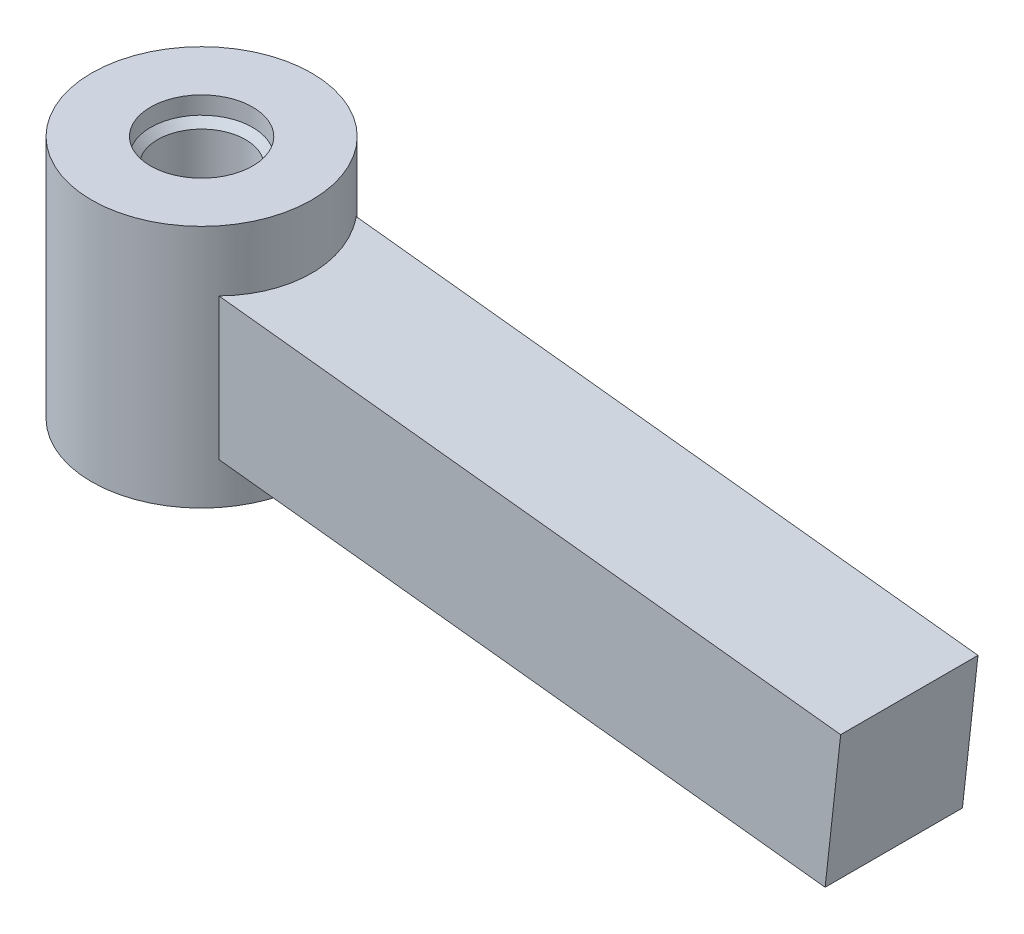
ISO-10303-21;
HEADER;
FILE_DESCRIPTION(('STEP AP214'),'2;1');
FILE_NAME('part.step','',(''),(''),'','','');
FILE_SCHEMA(('AUTOMOTIVE_DESIGN { 1 0 10303 214 1 1 1 1 }'));
ENDSEC;
DATA;
#1=APPLICATION_CONTEXT('core data for automotive mechanical design processes');
#2=APPLICATION_PROTOCOL_DEFINITION('international standard','automotive_design',2000,#1);
#3=PRODUCT_CONTEXT('',#1,'mechanical');
#4=PRODUCT('Part','Part','',(#3));
#5=PRODUCT_RELATED_PRODUCT_CATEGORY('part','',(#4));
#6=PRODUCT_DEFINITION_FORMATION('','',#4);
#7=PRODUCT_DEFINITION_CONTEXT('part definition',#1,'design');
#8=PRODUCT_DEFINITION('design','',#6,#7);
#9=PRODUCT_DEFINITION_SHAPE('','',#8);
#10=(LENGTH_UNIT() NAMED_UNIT(*) SI_UNIT(.MILLI.,.METRE.));
#11=(NAMED_UNIT(*) PLANE_ANGLE_UNIT() SI_UNIT($,.RADIAN.));
#12=(NAMED_UNIT(*) SI_UNIT($,.STERADIAN.) SOLID_ANGLE_UNIT());
#13=UNCERTAINTY_MEASURE_WITH_UNIT(LENGTH_MEASURE(1.E-05),#10,'distance_accuracy_value','');
#14=(GEOMETRIC_REPRESENTATION_CONTEXT(3) GLOBAL_UNCERTAINTY_ASSIGNED_CONTEXT((#13)) GLOBAL_UNIT_ASSIGNED_CONTEXT((#10,
#11,#12)) REPRESENTATION_CONTEXT('',''));
#15=CARTESIAN_POINT('',(0.,0.,0.));
#16=DIRECTION('',(0.,0.,1.));
#17=DIRECTION('',(1.,0.,0.));
#18=AXIS2_PLACEMENT_3D('',#15,#16,#17);
#19=CARTESIAN_POINT('',(0.,-8.8011,0.));
#20=DIRECTION('',(0.,1.,0.));
#21=DIRECTION('',(0.,0.,1.));
#22=AXIS2_PLACEMENT_3D('',#19,#20,#21);
#23=CYLINDRICAL_SURFACE('',#22,3.68300000002364);
#24=CARTESIAN_POINT('',(0.,-7.53110000005108,0.));
#25=DIRECTION('',(0.,-1.,0.));
#26=DIRECTION('',(0.,0.,-1.));
#27=AXIS2_PLACEMENT_3D('',#24,#25,#26);
#28=CIRCLE('',#27,3.68300000002364);
#29=CARTESIAN_POINT('',(0.,-7.53110000005108,-3.68300000002364));
#30=VERTEX_POINT('',#29);
#31=EDGE_CURVE('E122',#30,#30,#28,.F.);
#32=ORIENTED_EDGE('',*,*,#31,.T.);
#33=EDGE_LOOP('',(#32));
#34=FACE_BOUND('',#33,.T.);
#35=CARTESIAN_POINT('',(0.,-8.8011,0.));
#36=DIRECTION('',(0.,1.,0.));
#37=DIRECTION('',(0.,0.,1.));
#38=AXIS2_PLACEMENT_3D('',#35,#36,#37);
#39=CIRCLE('',#38,3.68300000002364);
#40=CARTESIAN_POINT('',(0.,-8.8011,3.68300000002364));
#41=VERTEX_POINT('',#40);
#42=EDGE_CURVE('E100',#41,#41,#39,.T.);
#43=ORIENTED_EDGE('',*,*,#42,.F.);
#44=EDGE_LOOP('',(#43));
#45=FACE_BOUND('',#44,.T.);
#46=ADVANCED_FACE('F39',(#34,#45),#23,.F.);
#47=CARTESIAN_POINT('',(0.,-8.8011,0.));
#48=DIRECTION('',(0.,1.,0.));
#49=DIRECTION('',(0.,0.,1.));
#50=AXIS2_PLACEMENT_3D('',#47,#48,#49);
#51=CYLINDRICAL_SURFACE('',#50,7.9375);
#52=CARTESIAN_POINT('',(0.,8.8011,0.));
#53=DIRECTION('',(0.,1.,0.));
#54=DIRECTION('',(0.,0.,1.));
#55=AXIS2_PLACEMENT_3D('',#52,#53,#54);
#56=CIRCLE('',#55,7.9375);
#57=CARTESIAN_POINT('',(0.,8.8011,7.9375));
#58=VERTEX_POINT('',#57);
#59=EDGE_CURVE('E172',#58,#58,#56,.T.);
#60=ORIENTED_EDGE('',*,*,#59,.F.);
#61=EDGE_LOOP('',(#60));
#62=FACE_BOUND('',#61,.T.);
#63=CARTESIAN_POINT('',(0.,-8.8011,0.));
#64=DIRECTION('',(0.,1.,0.));
#65=DIRECTION('',(0.,0.,1.));
#66=AXIS2_PLACEMENT_3D('',#63,#64,#65);
#67=CIRCLE('',#66,7.9375);
#68=CARTESIAN_POINT('',(0.,-8.8011,7.9375));
#69=VERTEX_POINT('',#68);
#70=EDGE_CURVE('E97',#69,#69,#67,.T.);
#71=ORIENTED_EDGE('',*,*,#70,.T.);
#72=EDGE_LOOP('',(#71));
#73=FACE_BOUND('',#72,.T.);
#74=CARTESIAN_POINT('',(0.,-5.11125993296291,0.));
#75=DIRECTION('',(0.110428199945451,0.993884104237917,0.));
#76=DIRECTION('',(-0.993884104237917,0.110428199945451,0.));
#77=AXIS2_PLACEMENT_3D('',#74,#75,#76);
#78=ELLIPSE('',#77,7.98634364525455,7.9375);
#79=CARTESIAN_POINT('',(6.2025557030953,-5.80041177514817,4.953));
#80=VERTEX_POINT('',#79);
#81=CARTESIAN_POINT('',(6.2025557030953,-5.80041177514817,-4.953));
#82=VERTEX_POINT('',#81);
#83=EDGE_CURVE('E61',#80,#82,#78,.T.);
#84=ORIENTED_EDGE('',*,*,#83,.F.);
#85=DIRECTION('',(0.,1.,0.));
#86=VECTOR('',#85,1.);
#87=CARTESIAN_POINT('',(6.2025557030953,-8.8011,4.953));
#88=LINE('',#87,#86);
#89=CARTESIAN_POINT('',(6.2025557030953,4.42210809077765,4.953));
#90=VERTEX_POINT('',#89);
#91=EDGE_CURVE('E54',#80,#90,#88,.T.);
#92=ORIENTED_EDGE('',*,*,#91,.T.);
#93=CARTESIAN_POINT('',(0.,5.11125993296291,0.));
#94=DIRECTION('',(0.110428199945451,0.993884104237917,0.));
#95=DIRECTION('',(-0.993884104237917,0.110428199945451,0.));
#96=AXIS2_PLACEMENT_3D('',#93,#94,#95);
#97=ELLIPSE('',#96,7.98634364525455,7.9375);
#98=CARTESIAN_POINT('',(6.2025557030953,4.42210809077765,-4.953));
#99=VERTEX_POINT('',#98);
#100=EDGE_CURVE('E11',#90,#99,#97,.T.);
#101=ORIENTED_EDGE('',*,*,#100,.T.);
#102=DIRECTION('',(0.,1.,0.));
#103=VECTOR('',#102,1.);
#104=CARTESIAN_POINT('',(6.2025557030953,-8.8011,-4.953));
#105=LINE('',#104,#103);
#106=EDGE_CURVE('E91',#99,#82,#105,.F.);
#107=ORIENTED_EDGE('',*,*,#106,.T.);
#108=EDGE_LOOP('',(#84,#92,#101,#107));
#109=FACE_BOUND('',#108,.T.);
#110=ADVANCED_FACE('F96',(#62,#73,#109),#51,.T.);
#111=CARTESIAN_POINT('',(0.,-8.8011,0.));
#112=DIRECTION('',(0.,1.,0.));
#113=DIRECTION('',(0.,0.,1.));
#114=AXIS2_PLACEMENT_3D('',#111,#112,#113);
#115=PLANE('',#114);
#116=ORIENTED_EDGE('',*,*,#42,.T.);
#117=EDGE_LOOP('',(#116));
#118=FACE_BOUND('',#117,.T.);
#119=ORIENTED_EDGE('',*,*,#70,.F.);
#120=EDGE_LOOP('',(#119));
#121=FACE_BOUND('',#120,.T.);
#122=ADVANCED_FACE('F151',(#118,#121),#115,.F.);
#123=CARTESIAN_POINT('',(0.,7.53110000005108,0.));
#124=DIRECTION('',(0.,1.,0.));
#125=DIRECTION('',(-1.,0.,0.));
#126=AXIS2_PLACEMENT_3D('',#123,#124,#125);
#127=CIRCLE('',#126,3.68300000002364);
#128=CARTESIAN_POINT('',(-3.68300000002364,7.53110000005108,0.));
#129=VERTEX_POINT('',#128);
#130=EDGE_CURVE('E47',#129,#129,#127,.F.);
#131=ORIENTED_EDGE('',*,*,#130,.T.);
#132=EDGE_LOOP('',(#131));
#133=FACE_BOUND('',#132,.T.);
#134=CARTESIAN_POINT('',(0.,8.8011,0.));
#135=DIRECTION('',(0.,1.,0.));
#136=DIRECTION('',(0.,0.,1.));
#137=AXIS2_PLACEMENT_3D('',#134,#135,#136);
#138=CIRCLE('',#137,3.68300000002364);
#139=CARTESIAN_POINT('',(0.,8.8011,3.68300000002364));
#140=VERTEX_POINT('',#139);
#141=EDGE_CURVE('E170',#140,#140,#138,.T.);
#142=ORIENTED_EDGE('',*,*,#141,.T.);
#143=EDGE_LOOP('',(#142));
#144=FACE_BOUND('',#143,.T.);
#145=ADVANCED_FACE('F146',(#133,#144),#23,.F.);
#146=CARTESIAN_POINT('',(0.,8.8011,0.));
#147=DIRECTION('',(0.,1.,0.));
#148=DIRECTION('',(0.,0.,1.));
#149=AXIS2_PLACEMENT_3D('',#146,#147,#148);
#150=PLANE('',#149);
#151=ORIENTED_EDGE('',*,*,#59,.T.);
#152=EDGE_LOOP('',(#151));
#153=FACE_BOUND('',#152,.T.);
#154=ORIENTED_EDGE('',*,*,#141,.F.);
#155=EDGE_LOOP('',(#154));
#156=FACE_BOUND('',#155,.T.);
#157=ADVANCED_FACE('F157',(#153,#156),#150,.T.);
#158=CARTESIAN_POINT('',(49.9283372395633,-10.6586838067575,0.));
#159=DIRECTION('',(0.993884104237917,-0.110428199945451,0.));
#160=DIRECTION('',(0.110428199945451,0.993884104237918,0.));
#161=AXIS2_PLACEMENT_3D('',#158,#159,#160);
#162=PLANE('',#161);
#163=DIRECTION('',(0.110428199945451,0.993884104237917,0.));
#164=VECTOR('',#163,1.);
#165=CARTESIAN_POINT('',(49.9283372395633,-10.6586838067575,-4.953));
#166=LINE('',#165,#164);
#167=CARTESIAN_POINT('',(49.9283372395633,-10.6586838067575,-4.953));
#168=VERTEX_POINT('',#167);
#169=CARTESIAN_POINT('',(51.0502877510091,-0.560821307700301,-4.953));
#170=VERTEX_POINT('',#169);
#171=EDGE_CURVE('E114',#168,#170,#166,.T.);
#172=ORIENTED_EDGE('',*,*,#171,.T.);
#173=DIRECTION('',(0.,0.,-1.));
#174=VECTOR('',#173,1.);
#175=CARTESIAN_POINT('',(51.0502877510091,-0.560821307700301,0.));
#176=LINE('',#175,#174);
#177=CARTESIAN_POINT('',(51.0502877510091,-0.560821307700301,4.953));
#178=VERTEX_POINT('',#177);
#179=EDGE_CURVE('E86',#178,#170,#176,.T.);
#180=ORIENTED_EDGE('',*,*,#179,.F.);
#181=DIRECTION('',(0.110428199945451,0.993884104237917,0.));
#182=VECTOR('',#181,1.);
#183=CARTESIAN_POINT('',(49.9283372395633,-10.6586838067575,4.953));
#184=LINE('',#183,#182);
#185=CARTESIAN_POINT('',(49.9283372395633,-10.6586838067575,4.953));
#186=VERTEX_POINT('',#185);
#187=EDGE_CURVE('E113',#186,#178,#184,.T.);
#188=ORIENTED_EDGE('',*,*,#187,.F.);
#189=DIRECTION('',(0.,0.,-1.));
#190=VECTOR('',#189,1.);
#191=CARTESIAN_POINT('',(49.9283372395633,-10.6586838067575,0.));
#192=LINE('',#191,#190);
#193=EDGE_CURVE('E109',#186,#168,#192,.T.);
#194=ORIENTED_EDGE('',*,*,#193,.T.);
#195=EDGE_LOOP('',(#172,#180,#188,#194));
#196=FACE_BOUND('',#195,.T.);
#197=ADVANCED_FACE('F163',(#196),#162,.T.);
#198=CARTESIAN_POINT('',(0.560975255722892,5.04893124952862,0.));
#199=DIRECTION('',(0.110428199945451,0.993884104237917,0.));
#200=DIRECTION('',(-0.993884104237917,0.110428199945451,0.));
#201=AXIS2_PLACEMENT_3D('',#198,#199,#200);
#202=PLANE('',#201);
#203=ORIENTED_EDGE('',*,*,#100,.F.);
#204=DIRECTION('',(0.993884104237917,-0.110428199945451,0.));
#205=VECTOR('',#204,1.);
#206=CARTESIAN_POINT('',(0.560975255722893,5.04893124952862,4.953));
#207=LINE('',#206,#205);
#208=EDGE_CURVE('E105',#90,#178,#207,.T.);
#209=ORIENTED_EDGE('',*,*,#208,.T.);
#210=ORIENTED_EDGE('',*,*,#179,.T.);
#211=DIRECTION('',(-0.993884104237917,0.110428199945451,0.));
#212=VECTOR('',#211,1.);
#213=CARTESIAN_POINT('',(0.560975255722892,5.04893124952862,-4.953));
#214=LINE('',#213,#212);
#215=EDGE_CURVE('E82',#170,#99,#214,.T.);
#216=ORIENTED_EDGE('',*,*,#215,.T.);
#217=EDGE_LOOP('',(#203,#209,#210,#216));
#218=FACE_BOUND('',#217,.T.);
#219=ADVANCED_FACE('F84',(#218),#202,.T.);
#220=CARTESIAN_POINT('',(-0.560975255722892,-5.04893124952862,0.));
#221=DIRECTION('',(0.110428199945451,0.993884104237917,0.));
#222=DIRECTION('',(-0.993884104237917,0.110428199945451,0.));
#223=AXIS2_PLACEMENT_3D('',#220,#221,#222);
#224=PLANE('',#223);
#225=DIRECTION('',(0.993884104237917,-0.110428199945451,0.));
#226=VECTOR('',#225,1.);
#227=CARTESIAN_POINT('',(-0.560975255722892,-5.04893124952862,4.953));
#228=LINE('',#227,#226);
#229=EDGE_CURVE('E88',#80,#186,#228,.T.);
#230=ORIENTED_EDGE('',*,*,#229,.F.);
#231=ORIENTED_EDGE('',*,*,#83,.T.);
#232=DIRECTION('',(-0.993884104237917,0.110428199945451,0.));
#233=VECTOR('',#232,1.);
#234=CARTESIAN_POINT('',(-0.560975255722892,-5.04893124952862,-4.953));
#235=LINE('',#234,#233);
#236=EDGE_CURVE('E93',#168,#82,#235,.T.);
#237=ORIENTED_EDGE('',*,*,#236,.F.);
#238=ORIENTED_EDGE('',*,*,#193,.F.);
#239=EDGE_LOOP('',(#230,#231,#237,#238));
#240=FACE_BOUND('',#239,.T.);
#241=ADVANCED_FACE('F193',(#240),#224,.F.);
#242=CARTESIAN_POINT('',(-0.560975255722892,-5.04893124952862,4.953));
#243=DIRECTION('',(0.,0.,1.));
#244=DIRECTION('',(1.,0.,0.));
#245=AXIS2_PLACEMENT_3D('',#242,#243,#244);
#246=PLANE('',#245);
#247=ORIENTED_EDGE('',*,*,#91,.F.);
#248=ORIENTED_EDGE('',*,*,#229,.T.);
#249=ORIENTED_EDGE('',*,*,#187,.T.);
#250=ORIENTED_EDGE('',*,*,#208,.F.);
#251=EDGE_LOOP('',(#247,#248,#249,#250));
#252=FACE_BOUND('',#251,.T.);
#253=ADVANCED_FACE('F142',(#252),#246,.T.);
#254=CARTESIAN_POINT('',(-0.560975255722892,-5.04893124952862,-4.953));
#255=DIRECTION('',(0.,0.,-1.));
#256=DIRECTION('',(-1.,0.,0.));
#257=AXIS2_PLACEMENT_3D('',#254,#255,#256);
#258=PLANE('',#257);
#259=ORIENTED_EDGE('',*,*,#106,.F.);
#260=ORIENTED_EDGE('',*,*,#215,.F.);
#261=ORIENTED_EDGE('',*,*,#171,.F.);
#262=ORIENTED_EDGE('',*,*,#236,.T.);
#263=EDGE_LOOP('',(#259,#260,#261,#262));
#264=FACE_BOUND('',#263,.T.);
#265=ADVANCED_FACE('F92',(#264),#258,.T.);
#266=CARTESIAN_POINT('',(0.,0.,0.));
#267=DIRECTION('',(0.,1.,0.));
#268=DIRECTION('',(0.,0.,1.));
#269=AXIS2_PLACEMENT_3D('',#266,#267,#268);
#270=CYLINDRICAL_SURFACE('',#269,3.175);
#271=CARTESIAN_POINT('',(0.,7.02310000002626,0.));
#272=DIRECTION('',(0.,1.,0.));
#273=DIRECTION('',(0.,0.,-1.));
#274=AXIS2_PLACEMENT_3D('',#271,#272,#273);
#275=CIRCLE('',#274,3.17499999999882);
#276=CARTESIAN_POINT('',(0.,7.02310000002626,-3.17499999999882));
#277=VERTEX_POINT('',#276);
#278=EDGE_CURVE('E119',#277,#277,#275,.T.);
#279=ORIENTED_EDGE('',*,*,#278,.T.);
#280=EDGE_LOOP('',(#279));
#281=FACE_BOUND('',#280,.T.);
#282=CARTESIAN_POINT('',(0.,-7.02310000002626,0.));
#283=DIRECTION('',(0.,-1.,0.));
#284=DIRECTION('',(0.,0.,-1.));
#285=AXIS2_PLACEMENT_3D('',#282,#283,#284);
#286=CIRCLE('',#285,3.17499999999882);
#287=CARTESIAN_POINT('',(0.,-7.02310000002626,-3.17499999999882));
#288=VERTEX_POINT('',#287);
#289=EDGE_CURVE('E116',#288,#288,#286,.T.);
#290=ORIENTED_EDGE('',*,*,#289,.T.);
#291=EDGE_LOOP('',(#290));
#292=FACE_BOUND('',#291,.T.);
#293=ADVANCED_FACE('F41',(#281,#292),#270,.F.);
#294=CARTESIAN_POINT('',(0.,-7.53110000010793,0.));
#295=DIRECTION('',(0.,-1.,0.));
#296=DIRECTION('',(0.,0.,-1.));
#297=AXIS2_PLACEMENT_3D('',#294,#295,#296);
#298=CONICAL_SURFACE('',#297,3.68300000008048,0.785398163397448);
#299=ORIENTED_EDGE('',*,*,#31,.F.);
#300=EDGE_LOOP('',(#299));
#301=FACE_BOUND('',#300,.T.);
#302=ORIENTED_EDGE('',*,*,#289,.F.);
#303=EDGE_LOOP('',(#302));
#304=FACE_BOUND('',#303,.T.);
#305=ADVANCED_FACE('F131',(#301,#304),#298,.F.);
#306=CARTESIAN_POINT('',(0.,7.53110000010793,0.));
#307=DIRECTION('',(0.,1.,0.));
#308=DIRECTION('',(-1.,0.,0.));
#309=AXIS2_PLACEMENT_3D('',#306,#307,#308);
#310=CONICAL_SURFACE('',#309,3.68300000008048,0.785398163397448);
#311=ORIENTED_EDGE('',*,*,#130,.F.);
#312=EDGE_LOOP('',(#311));
#313=FACE_BOUND('',#312,.T.);
#314=ORIENTED_EDGE('',*,*,#278,.F.);
#315=EDGE_LOOP('',(#314));
#316=FACE_BOUND('',#315,.T.);
#317=ADVANCED_FACE('F134',(#313,#316),#310,.F.);
#318=CLOSED_SHELL('',(#46,#110,#122,#145,#157,#197,#219,#241,#253,#265,#293,#305,#317));
#319=MANIFOLD_SOLID_BREP('B2',#318);
#320=ADVANCED_BREP_SHAPE_REPRESENTATION('',(#18,#319),#14);
#321=SHAPE_DEFINITION_REPRESENTATION(#9,#320);
ENDSEC;
END-ISO-10303-21;
